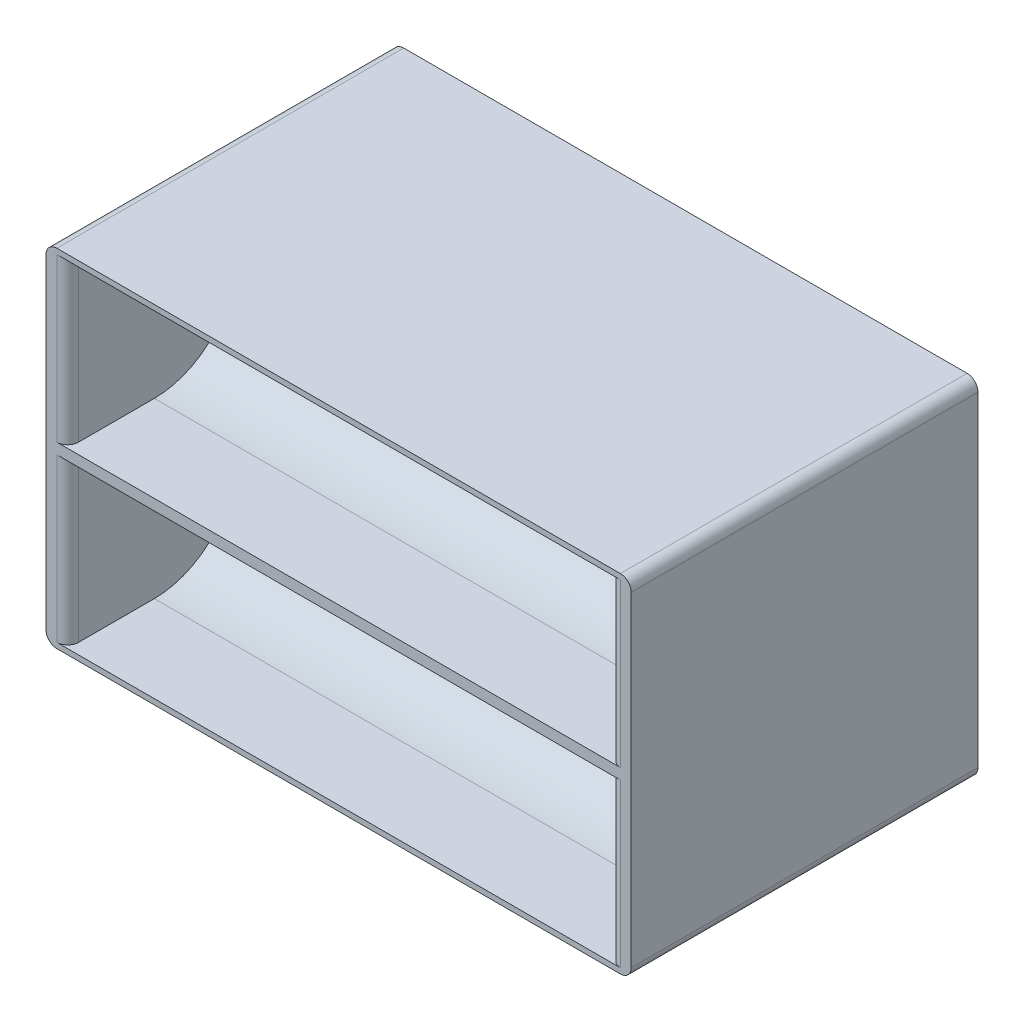
ISO-10303-21;
HEADER;
FILE_DESCRIPTION(('STEP AP214'),'2;1');
FILE_NAME('part.step','',(''),(''),'','','');
FILE_SCHEMA(('AUTOMOTIVE_DESIGN { 1 0 10303 214 1 1 1 1 }'));
ENDSEC;
DATA;
#1=APPLICATION_CONTEXT('core data for automotive mechanical design processes');
#2=APPLICATION_PROTOCOL_DEFINITION('international standard','automotive_design',2000,#1);
#3=PRODUCT_CONTEXT('',#1,'mechanical');
#4=PRODUCT('Part','Part','',(#3));
#5=PRODUCT_RELATED_PRODUCT_CATEGORY('part','',(#4));
#6=PRODUCT_DEFINITION_FORMATION('','',#4);
#7=PRODUCT_DEFINITION_CONTEXT('part definition',#1,'design');
#8=PRODUCT_DEFINITION('design','',#6,#7);
#9=PRODUCT_DEFINITION_SHAPE('','',#8);
#10=(LENGTH_UNIT() NAMED_UNIT(*) SI_UNIT(.MILLI.,.METRE.));
#11=(NAMED_UNIT(*) PLANE_ANGLE_UNIT() SI_UNIT($,.RADIAN.));
#12=(NAMED_UNIT(*) SI_UNIT($,.STERADIAN.) SOLID_ANGLE_UNIT());
#13=UNCERTAINTY_MEASURE_WITH_UNIT(LENGTH_MEASURE(1.E-05),#10,'distance_accuracy_value','');
#14=(GEOMETRIC_REPRESENTATION_CONTEXT(3) GLOBAL_UNCERTAINTY_ASSIGNED_CONTEXT((#13)) GLOBAL_UNIT_ASSIGNED_CONTEXT((#10,
#11,#12)) REPRESENTATION_CONTEXT('',''));
#15=CARTESIAN_POINT('',(0.,0.,0.));
#16=DIRECTION('',(0.,0.,1.));
#17=DIRECTION('',(1.,0.,0.));
#18=AXIS2_PLACEMENT_3D('',#15,#16,#17);
#19=CARTESIAN_POINT('',(27.,32.,16.));
#20=DIRECTION('',(0.,0.,-1.));
#21=DIRECTION('',(-1.,0.,0.));
#22=AXIS2_PLACEMENT_3D('',#19,#20,#21);
#23=PLANE('',#22);
#24=DIRECTION('',(0.,-1.,0.));
#25=VECTOR('',#24,1.);
#26=CARTESIAN_POINT('',(-27.,32.,16.));
#27=LINE('',#26,#25);
#28=CARTESIAN_POINT('',(-27.,31.,16.));
#29=VERTEX_POINT('',#28);
#30=CARTESIAN_POINT('',(-27.,1.,16.));
#31=VERTEX_POINT('',#30);
#32=EDGE_CURVE('E376',#29,#31,#27,.T.);
#33=ORIENTED_EDGE('',*,*,#32,.T.);
#34=CARTESIAN_POINT('',(-26.,1.,16.));
#35=DIRECTION('',(0.,0.,-1.));
#36=DIRECTION('',(-1.,0.,0.));
#37=AXIS2_PLACEMENT_3D('',#34,#35,#36);
#38=CIRCLE('',#37,1.);
#39=CARTESIAN_POINT('',(-26.,0.,16.));
#40=VERTEX_POINT('',#39);
#41=EDGE_CURVE('E402',#31,#40,#38,.F.);
#42=ORIENTED_EDGE('',*,*,#41,.T.);
#43=DIRECTION('',(1.,0.,0.));
#44=VECTOR('',#43,1.);
#45=CARTESIAN_POINT('',(27.,0.,16.));
#46=LINE('',#45,#44);
#47=CARTESIAN_POINT('',(26.,0.,16.));
#48=VERTEX_POINT('',#47);
#49=EDGE_CURVE('E355',#40,#48,#46,.T.);
#50=ORIENTED_EDGE('',*,*,#49,.T.);
#51=CARTESIAN_POINT('',(26.,1.,16.));
#52=DIRECTION('',(0.,0.,-1.));
#53=DIRECTION('',(-1.,0.,0.));
#54=AXIS2_PLACEMENT_3D('',#51,#52,#53);
#55=CIRCLE('',#54,1.);
#56=CARTESIAN_POINT('',(27.,1.,16.));
#57=VERTEX_POINT('',#56);
#58=EDGE_CURVE('E400',#48,#57,#55,.F.);
#59=ORIENTED_EDGE('',*,*,#58,.T.);
#60=DIRECTION('',(0.,-1.,0.));
#61=VECTOR('',#60,1.);
#62=CARTESIAN_POINT('',(27.,32.,16.));
#63=LINE('',#62,#61);
#64=CARTESIAN_POINT('',(27.,31.,16.));
#65=VERTEX_POINT('',#64);
#66=EDGE_CURVE('E373',#65,#57,#63,.T.);
#67=ORIENTED_EDGE('',*,*,#66,.F.);
#68=CARTESIAN_POINT('',(26.,31.,16.));
#69=DIRECTION('',(0.,0.,-1.));
#70=DIRECTION('',(-1.,0.,0.));
#71=AXIS2_PLACEMENT_3D('',#68,#69,#70);
#72=CIRCLE('',#71,1.);
#73=CARTESIAN_POINT('',(26.,32.,16.));
#74=VERTEX_POINT('',#73);
#75=EDGE_CURVE('E398',#65,#74,#72,.F.);
#76=ORIENTED_EDGE('',*,*,#75,.T.);
#77=DIRECTION('',(1.,0.,0.));
#78=VECTOR('',#77,1.);
#79=CARTESIAN_POINT('',(27.,32.,16.));
#80=LINE('',#79,#78);
#81=CARTESIAN_POINT('',(-26.,32.,16.));
#82=VERTEX_POINT('',#81);
#83=EDGE_CURVE('E356',#82,#74,#80,.T.);
#84=ORIENTED_EDGE('',*,*,#83,.F.);
#85=CARTESIAN_POINT('',(-26.,31.,16.));
#86=DIRECTION('',(0.,0.,-1.));
#87=DIRECTION('',(-1.,0.,0.));
#88=AXIS2_PLACEMENT_3D('',#85,#86,#87);
#89=CIRCLE('',#88,1.);
#90=EDGE_CURVE('E396',#82,#29,#89,.F.);
#91=ORIENTED_EDGE('',*,*,#90,.T.);
#92=EDGE_LOOP('',(#33,#42,#50,#59,#67,#76,#84,#91));
#93=FACE_BOUND('',#92,.T.);
#94=DIRECTION('',(-1.,0.,0.));
#95=VECTOR('',#94,1.);
#96=CARTESIAN_POINT('',(25.,16.5,16.));
#97=LINE('',#96,#95);
#98=CARTESIAN_POINT('',(26.,16.5,16.));
#99=VERTEX_POINT('',#98);
#100=CARTESIAN_POINT('',(-26.,16.5,16.));
#101=VERTEX_POINT('',#100);
#102=EDGE_CURVE('E302',#99,#101,#97,.T.);
#103=ORIENTED_EDGE('',*,*,#102,.T.);
#104=DIRECTION('',(0.,-1.,0.));
#105=VECTOR('',#104,1.);
#106=CARTESIAN_POINT('',(-26.,31.5,16.));
#107=LINE('',#106,#105);
#108=CARTESIAN_POINT('',(-26.,31.5,16.));
#109=VERTEX_POINT('',#108);
#110=EDGE_CURVE('E387',#101,#109,#107,.F.);
#111=ORIENTED_EDGE('',*,*,#110,.T.);
#112=DIRECTION('',(-1.,0.,0.));
#113=VECTOR('',#112,1.);
#114=CARTESIAN_POINT('',(25.,31.5,16.));
#115=LINE('',#114,#113);
#116=CARTESIAN_POINT('',(26.,31.5,16.));
#117=VERTEX_POINT('',#116);
#118=EDGE_CURVE('E304',#117,#109,#115,.T.);
#119=ORIENTED_EDGE('',*,*,#118,.F.);
#120=DIRECTION('',(0.,-1.,0.));
#121=VECTOR('',#120,1.);
#122=CARTESIAN_POINT('',(26.,32.,16.));
#123=LINE('',#122,#121);
#124=EDGE_CURVE('E384',#117,#99,#123,.T.);
#125=ORIENTED_EDGE('',*,*,#124,.T.);
#126=EDGE_LOOP('',(#103,#111,#119,#125));
#127=FACE_BOUND('',#126,.T.);
#128=DIRECTION('',(0.,-1.,0.));
#129=VECTOR('',#128,1.);
#130=CARTESIAN_POINT('',(26.,0.5,16.));
#131=LINE('',#130,#129);
#132=CARTESIAN_POINT('',(26.,15.5,16.));
#133=VERTEX_POINT('',#132);
#134=CARTESIAN_POINT('',(26.,0.5,16.));
#135=VERTEX_POINT('',#134);
#136=EDGE_CURVE('E393',#133,#135,#131,.T.);
#137=ORIENTED_EDGE('',*,*,#136,.T.);
#138=DIRECTION('',(-1.,0.,0.));
#139=VECTOR('',#138,1.);
#140=CARTESIAN_POINT('',(25.,0.5,16.));
#141=LINE('',#140,#139);
#142=CARTESIAN_POINT('',(-26.,0.5,16.));
#143=VERTEX_POINT('',#142);
#144=EDGE_CURVE('E264',#135,#143,#141,.T.);
#145=ORIENTED_EDGE('',*,*,#144,.T.);
#146=DIRECTION('',(0.,-1.,0.));
#147=VECTOR('',#146,1.);
#148=CARTESIAN_POINT('',(-26.,32.,16.));
#149=LINE('',#148,#147);
#150=CARTESIAN_POINT('',(-26.,15.5,16.));
#151=VERTEX_POINT('',#150);
#152=EDGE_CURVE('E390',#143,#151,#149,.F.);
#153=ORIENTED_EDGE('',*,*,#152,.T.);
#154=DIRECTION('',(-1.,0.,0.));
#155=VECTOR('',#154,1.);
#156=CARTESIAN_POINT('',(25.,15.5,16.));
#157=LINE('',#156,#155);
#158=EDGE_CURVE('E279',#133,#151,#157,.T.);
#159=ORIENTED_EDGE('',*,*,#158,.F.);
#160=EDGE_LOOP('',(#137,#145,#153,#159));
#161=FACE_BOUND('',#160,.T.);
#162=ADVANCED_FACE('F35',(#93,#127,#161),#23,.F.);
#163=CARTESIAN_POINT('',(27.,32.,-16.));
#164=DIRECTION('',(0.,0.,1.));
#165=DIRECTION('',(1.,0.,0.));
#166=AXIS2_PLACEMENT_3D('',#163,#164,#165);
#167=PLANE('',#166);
#168=DIRECTION('',(0.,1.,0.));
#169=VECTOR('',#168,1.);
#170=CARTESIAN_POINT('',(26.,32.,-16.));
#171=LINE('',#170,#169);
#172=CARTESIAN_POINT('',(26.,0.5,-16.));
#173=VERTEX_POINT('',#172);
#174=CARTESIAN_POINT('',(26.,15.5,-16.));
#175=VERTEX_POINT('',#174);
#176=EDGE_CURVE('E417',#173,#175,#171,.T.);
#177=ORIENTED_EDGE('',*,*,#176,.T.);
#178=DIRECTION('',(-1.,0.,0.));
#179=VECTOR('',#178,1.);
#180=CARTESIAN_POINT('',(25.,15.5,-16.));
#181=LINE('',#180,#179);
#182=CARTESIAN_POINT('',(-26.,15.5,-16.));
#183=VERTEX_POINT('',#182);
#184=EDGE_CURVE('E328',#175,#183,#181,.T.);
#185=ORIENTED_EDGE('',*,*,#184,.T.);
#186=DIRECTION('',(0.,1.,0.));
#187=VECTOR('',#186,1.);
#188=CARTESIAN_POINT('',(-26.,0.5,-16.));
#189=LINE('',#188,#187);
#190=CARTESIAN_POINT('',(-26.,0.5,-16.));
#191=VERTEX_POINT('',#190);
#192=EDGE_CURVE('E414',#183,#191,#189,.F.);
#193=ORIENTED_EDGE('',*,*,#192,.T.);
#194=DIRECTION('',(-1.,0.,0.));
#195=VECTOR('',#194,1.);
#196=CARTESIAN_POINT('',(25.,0.5,-16.));
#197=LINE('',#196,#195);
#198=EDGE_CURVE('E330',#173,#191,#197,.T.);
#199=ORIENTED_EDGE('',*,*,#198,.F.);
#200=EDGE_LOOP('',(#177,#185,#193,#199));
#201=FACE_BOUND('',#200,.T.);
#202=DIRECTION('',(-1.,0.,0.));
#203=VECTOR('',#202,1.);
#204=CARTESIAN_POINT('',(27.,0.,-16.));
#205=LINE('',#204,#203);
#206=CARTESIAN_POINT('',(26.,0.,-16.));
#207=VERTEX_POINT('',#206);
#208=CARTESIAN_POINT('',(-26.,0.,-16.));
#209=VERTEX_POINT('',#208);
#210=EDGE_CURVE('E360',#207,#209,#205,.T.);
#211=ORIENTED_EDGE('',*,*,#210,.T.);
#212=CARTESIAN_POINT('',(-26.,1.,-16.));
#213=DIRECTION('',(0.,0.,1.));
#214=DIRECTION('',(1.,0.,0.));
#215=AXIS2_PLACEMENT_3D('',#212,#213,#214);
#216=CIRCLE('',#215,1.);
#217=CARTESIAN_POINT('',(-27.,1.,-16.));
#218=VERTEX_POINT('',#217);
#219=EDGE_CURVE('E426',#209,#218,#216,.F.);
#220=ORIENTED_EDGE('',*,*,#219,.T.);
#221=DIRECTION('',(0.,-1.,0.));
#222=VECTOR('',#221,1.);
#223=CARTESIAN_POINT('',(-27.,32.,-16.));
#224=LINE('',#223,#222);
#225=CARTESIAN_POINT('',(-27.,31.,-16.));
#226=VERTEX_POINT('',#225);
#227=EDGE_CURVE('E363',#226,#218,#224,.T.);
#228=ORIENTED_EDGE('',*,*,#227,.F.);
#229=CARTESIAN_POINT('',(-26.,31.,-16.));
#230=DIRECTION('',(0.,0.,1.));
#231=DIRECTION('',(1.,0.,0.));
#232=AXIS2_PLACEMENT_3D('',#229,#230,#231);
#233=CIRCLE('',#232,1.);
#234=CARTESIAN_POINT('',(-26.,32.,-16.));
#235=VERTEX_POINT('',#234);
#236=EDGE_CURVE('E420',#226,#235,#233,.F.);
#237=ORIENTED_EDGE('',*,*,#236,.T.);
#238=DIRECTION('',(-1.,0.,0.));
#239=VECTOR('',#238,1.);
#240=CARTESIAN_POINT('',(27.,32.,-16.));
#241=LINE('',#240,#239);
#242=CARTESIAN_POINT('',(26.,32.,-16.));
#243=VERTEX_POINT('',#242);
#244=EDGE_CURVE('E359',#243,#235,#241,.T.);
#245=ORIENTED_EDGE('',*,*,#244,.F.);
#246=CARTESIAN_POINT('',(26.,31.,-16.));
#247=DIRECTION('',(0.,0.,1.));
#248=DIRECTION('',(1.,0.,0.));
#249=AXIS2_PLACEMENT_3D('',#246,#247,#248);
#250=CIRCLE('',#249,1.);
#251=CARTESIAN_POINT('',(27.,31.,-16.));
#252=VERTEX_POINT('',#251);
#253=EDGE_CURVE('E422',#243,#252,#250,.F.);
#254=ORIENTED_EDGE('',*,*,#253,.T.);
#255=DIRECTION('',(0.,-1.,0.));
#256=VECTOR('',#255,1.);
#257=CARTESIAN_POINT('',(27.,32.,-16.));
#258=LINE('',#257,#256);
#259=CARTESIAN_POINT('',(27.,1.,-16.));
#260=VERTEX_POINT('',#259);
#261=EDGE_CURVE('E370',#252,#260,#258,.T.);
#262=ORIENTED_EDGE('',*,*,#261,.T.);
#263=CARTESIAN_POINT('',(26.,1.,-16.));
#264=DIRECTION('',(0.,0.,1.));
#265=DIRECTION('',(1.,0.,0.));
#266=AXIS2_PLACEMENT_3D('',#263,#264,#265);
#267=CIRCLE('',#266,1.);
#268=EDGE_CURVE('E424',#260,#207,#267,.F.);
#269=ORIENTED_EDGE('',*,*,#268,.T.);
#270=EDGE_LOOP('',(#211,#220,#228,#237,#245,#254,#262,#269));
#271=FACE_BOUND('',#270,.T.);
#272=DIRECTION('',(-1.,0.,0.));
#273=VECTOR('',#272,1.);
#274=CARTESIAN_POINT('',(25.,31.5,-16.));
#275=LINE('',#274,#273);
#276=CARTESIAN_POINT('',(26.,31.5,-16.));
#277=VERTEX_POINT('',#276);
#278=CARTESIAN_POINT('',(-26.,31.5,-16.));
#279=VERTEX_POINT('',#278);
#280=EDGE_CURVE('E353',#277,#279,#275,.T.);
#281=ORIENTED_EDGE('',*,*,#280,.T.);
#282=DIRECTION('',(0.,1.,0.));
#283=VECTOR('',#282,1.);
#284=CARTESIAN_POINT('',(-26.,32.,-16.));
#285=LINE('',#284,#283);
#286=CARTESIAN_POINT('',(-26.,16.5,-16.));
#287=VERTEX_POINT('',#286);
#288=EDGE_CURVE('E411',#279,#287,#285,.F.);
#289=ORIENTED_EDGE('',*,*,#288,.T.);
#290=DIRECTION('',(-1.,0.,0.));
#291=VECTOR('',#290,1.);
#292=CARTESIAN_POINT('',(25.,16.5,-16.));
#293=LINE('',#292,#291);
#294=CARTESIAN_POINT('',(26.,16.5,-16.));
#295=VERTEX_POINT('',#294);
#296=EDGE_CURVE('E346',#295,#287,#293,.T.);
#297=ORIENTED_EDGE('',*,*,#296,.F.);
#298=DIRECTION('',(0.,1.,0.));
#299=VECTOR('',#298,1.);
#300=CARTESIAN_POINT('',(26.,31.5,-16.));
#301=LINE('',#300,#299);
#302=EDGE_CURVE('E408',#295,#277,#301,.T.);
#303=ORIENTED_EDGE('',*,*,#302,.T.);
#304=EDGE_LOOP('',(#281,#289,#297,#303));
#305=FACE_BOUND('',#304,.T.);
#306=ADVANCED_FACE('F512',(#201,#271,#305),#167,.F.);
#307=CARTESIAN_POINT('',(-27.,32.,16.));
#308=DIRECTION('',(1.,0.,0.));
#309=DIRECTION('',(0.,0.,-1.));
#310=AXIS2_PLACEMENT_3D('',#307,#308,#309);
#311=PLANE('',#310);
#312=ORIENTED_EDGE('',*,*,#227,.T.);
#313=DIRECTION('',(0.,0.,1.));
#314=VECTOR('',#313,1.);
#315=CARTESIAN_POINT('',(-27.,1.,16.));
#316=LINE('',#315,#314);
#317=EDGE_CURVE('E381',#218,#31,#316,.T.);
#318=ORIENTED_EDGE('',*,*,#317,.T.);
#319=ORIENTED_EDGE('',*,*,#32,.F.);
#320=DIRECTION('',(0.,0.,1.));
#321=VECTOR('',#320,1.);
#322=CARTESIAN_POINT('',(-27.,31.,-16.));
#323=LINE('',#322,#321);
#324=EDGE_CURVE('E379',#29,#226,#323,.F.);
#325=ORIENTED_EDGE('',*,*,#324,.T.);
#326=EDGE_LOOP('',(#312,#318,#319,#325));
#327=FACE_BOUND('',#326,.T.);
#328=ADVANCED_FACE('F514',(#327),#311,.F.);
#329=CARTESIAN_POINT('',(27.,32.,16.));
#330=DIRECTION('',(-1.,0.,0.));
#331=DIRECTION('',(0.,0.,1.));
#332=AXIS2_PLACEMENT_3D('',#329,#330,#331);
#333=PLANE('',#332);
#334=ORIENTED_EDGE('',*,*,#66,.T.);
#335=DIRECTION('',(0.,0.,-1.));
#336=VECTOR('',#335,1.);
#337=CARTESIAN_POINT('',(27.,1.,16.));
#338=LINE('',#337,#336);
#339=EDGE_CURVE('E430',#57,#260,#338,.T.);
#340=ORIENTED_EDGE('',*,*,#339,.T.);
#341=ORIENTED_EDGE('',*,*,#261,.F.);
#342=DIRECTION('',(0.,0.,-1.));
#343=VECTOR('',#342,1.);
#344=CARTESIAN_POINT('',(27.,31.,16.));
#345=LINE('',#344,#343);
#346=EDGE_CURVE('E428',#252,#65,#345,.F.);
#347=ORIENTED_EDGE('',*,*,#346,.T.);
#348=EDGE_LOOP('',(#334,#340,#341,#347));
#349=FACE_BOUND('',#348,.T.);
#350=ADVANCED_FACE('F522',(#349),#333,.F.);
#351=CARTESIAN_POINT('',(0.,32.,0.));
#352=DIRECTION('',(0.,1.,0.));
#353=DIRECTION('',(0.,0.,1.));
#354=AXIS2_PLACEMENT_3D('',#351,#352,#353);
#355=PLANE('',#354);
#356=ORIENTED_EDGE('',*,*,#83,.T.);
#357=DIRECTION('',(0.,0.,-1.));
#358=VECTOR('',#357,1.);
#359=CARTESIAN_POINT('',(26.,32.,-16.));
#360=LINE('',#359,#358);
#361=EDGE_CURVE('E436',#74,#243,#360,.T.);
#362=ORIENTED_EDGE('',*,*,#361,.T.);
#363=ORIENTED_EDGE('',*,*,#244,.T.);
#364=DIRECTION('',(0.,0.,1.));
#365=VECTOR('',#364,1.);
#366=CARTESIAN_POINT('',(-26.,32.,16.));
#367=LINE('',#366,#365);
#368=EDGE_CURVE('E433',#235,#82,#367,.T.);
#369=ORIENTED_EDGE('',*,*,#368,.T.);
#370=EDGE_LOOP('',(#356,#362,#363,#369));
#371=FACE_BOUND('',#370,.T.);
#372=ADVANCED_FACE('F533',(#371),#355,.T.);
#373=CARTESIAN_POINT('',(0.,0.,0.));
#374=DIRECTION('',(0.,1.,0.));
#375=DIRECTION('',(0.,0.,1.));
#376=AXIS2_PLACEMENT_3D('',#373,#374,#375);
#377=PLANE('',#376);
#378=ORIENTED_EDGE('',*,*,#49,.F.);
#379=DIRECTION('',(0.,0.,1.));
#380=VECTOR('',#379,1.);
#381=CARTESIAN_POINT('',(-26.,0.,0.));
#382=LINE('',#381,#380);
#383=EDGE_CURVE('E406',#40,#209,#382,.F.);
#384=ORIENTED_EDGE('',*,*,#383,.T.);
#385=ORIENTED_EDGE('',*,*,#210,.F.);
#386=DIRECTION('',(0.,0.,-1.));
#387=VECTOR('',#386,1.);
#388=CARTESIAN_POINT('',(26.,0.,0.));
#389=LINE('',#388,#387);
#390=EDGE_CURVE('E404',#207,#48,#389,.F.);
#391=ORIENTED_EDGE('',*,*,#390,.T.);
#392=EDGE_LOOP('',(#378,#384,#385,#391));
#393=FACE_BOUND('',#392,.T.);
#394=ADVANCED_FACE('F530',(#393),#377,.F.);
#395=CARTESIAN_POINT('',(25.,31.5,-8.));
#396=DIRECTION('',(0.,-1.,0.));
#397=DIRECTION('',(0.,0.,-1.));
#398=AXIS2_PLACEMENT_3D('',#395,#396,#397);
#399=PLANE('',#398);
#400=ORIENTED_EDGE('',*,*,#280,.F.);
#401=CARTESIAN_POINT('',(26.,31.5,-15.));
#402=DIRECTION('',(0.,-1.,0.));
#403=DIRECTION('',(0.,0.,-1.));
#404=AXIS2_PLACEMENT_3D('',#401,#402,#403);
#405=CIRCLE('',#404,1.);
#406=CARTESIAN_POINT('',(25.,31.5,-15.));
#407=VERTEX_POINT('',#406);
#408=EDGE_CURVE('E43',#277,#407,#405,.F.);
#409=ORIENTED_EDGE('',*,*,#408,.T.);
#410=DIRECTION('',(0.,0.,1.));
#411=VECTOR('',#410,1.);
#412=CARTESIAN_POINT('',(25.,31.5,-8.));
#413=LINE('',#412,#411);
#414=CARTESIAN_POINT('',(25.,31.5,-8.));
#415=VERTEX_POINT('',#414);
#416=EDGE_CURVE('E340',#407,#415,#413,.T.);
#417=ORIENTED_EDGE('',*,*,#416,.T.);
#418=DIRECTION('',(-1.,0.,0.));
#419=VECTOR('',#418,1.);
#420=CARTESIAN_POINT('',(25.,31.5,-8.));
#421=LINE('',#420,#419);
#422=CARTESIAN_POINT('',(-25.,31.5,-8.));
#423=VERTEX_POINT('',#422);
#424=EDGE_CURVE('E350',#415,#423,#421,.T.);
#425=ORIENTED_EDGE('',*,*,#424,.T.);
#426=DIRECTION('',(0.,0.,1.));
#427=VECTOR('',#426,1.);
#428=CARTESIAN_POINT('',(-25.,31.5,-8.));
#429=LINE('',#428,#427);
#430=CARTESIAN_POINT('',(-25.,31.5,-15.));
#431=VERTEX_POINT('',#430);
#432=EDGE_CURVE('E332',#431,#423,#429,.T.);
#433=ORIENTED_EDGE('',*,*,#432,.F.);
#434=CARTESIAN_POINT('',(-26.,31.5,-15.));
#435=DIRECTION('',(0.,-1.,0.));
#436=DIRECTION('',(0.,0.,-1.));
#437=AXIS2_PLACEMENT_3D('',#434,#435,#436);
#438=CIRCLE('',#437,1.);
#439=EDGE_CURVE('E485',#431,#279,#438,.F.);
#440=ORIENTED_EDGE('',*,*,#439,.T.);
#441=EDGE_LOOP('',(#400,#409,#417,#425,#433,#440));
#442=FACE_BOUND('',#441,.T.);
#443=ADVANCED_FACE('F502',(#442),#399,.T.);
#444=CARTESIAN_POINT('',(25.,24.,-8.));
#445=DIRECTION('',(-1.,0.,0.));
#446=DIRECTION('',(0.,0.,1.));
#447=AXIS2_PLACEMENT_3D('',#444,#445,#446);
#448=CYLINDRICAL_SURFACE('',#447,7.5);
#449=ORIENTED_EDGE('',*,*,#424,.F.);
#450=CARTESIAN_POINT('',(25.,24.,-8.));
#451=DIRECTION('',(1.,0.,0.));
#452=DIRECTION('',(0.,0.,1.));
#453=AXIS2_PLACEMENT_3D('',#450,#451,#452);
#454=CIRCLE('',#453,7.5);
#455=CARTESIAN_POINT('',(25.,16.5,-8.));
#456=VERTEX_POINT('',#455);
#457=EDGE_CURVE('E342',#415,#456,#454,.T.);
#458=ORIENTED_EDGE('',*,*,#457,.T.);
#459=DIRECTION('',(-1.,0.,0.));
#460=VECTOR('',#459,1.);
#461=CARTESIAN_POINT('',(25.,16.5,-8.));
#462=LINE('',#461,#460);
#463=CARTESIAN_POINT('',(-25.,16.5,-8.));
#464=VERTEX_POINT('',#463);
#465=EDGE_CURVE('E348',#456,#464,#462,.T.);
#466=ORIENTED_EDGE('',*,*,#465,.T.);
#467=CARTESIAN_POINT('',(-25.,24.,-8.));
#468=DIRECTION('',(1.,0.,0.));
#469=DIRECTION('',(0.,0.,1.));
#470=AXIS2_PLACEMENT_3D('',#467,#468,#469);
#471=CIRCLE('',#470,7.5);
#472=EDGE_CURVE('E334',#423,#464,#471,.T.);
#473=ORIENTED_EDGE('',*,*,#472,.F.);
#474=EDGE_LOOP('',(#449,#458,#466,#473));
#475=FACE_BOUND('',#474,.T.);
#476=ADVANCED_FACE('F506',(#475),#448,.F.);
#477=CARTESIAN_POINT('',(25.,16.5,-16.));
#478=DIRECTION('',(0.,1.,0.));
#479=DIRECTION('',(0.,0.,1.));
#480=AXIS2_PLACEMENT_3D('',#477,#478,#479);
#481=PLANE('',#480);
#482=ORIENTED_EDGE('',*,*,#465,.F.);
#483=DIRECTION('',(0.,0.,-1.));
#484=VECTOR('',#483,1.);
#485=CARTESIAN_POINT('',(25.,16.5,-16.));
#486=LINE('',#485,#484);
#487=CARTESIAN_POINT('',(25.,16.5,-15.));
#488=VERTEX_POINT('',#487);
#489=EDGE_CURVE('E344',#456,#488,#486,.T.);
#490=ORIENTED_EDGE('',*,*,#489,.T.);
#491=CARTESIAN_POINT('',(26.,16.5,-15.));
#492=DIRECTION('',(0.,1.,0.));
#493=DIRECTION('',(0.,0.,1.));
#494=AXIS2_PLACEMENT_3D('',#491,#492,#493);
#495=CIRCLE('',#494,1.);
#496=EDGE_CURVE('E11',#488,#295,#495,.F.);
#497=ORIENTED_EDGE('',*,*,#496,.T.);
#498=ORIENTED_EDGE('',*,*,#296,.T.);
#499=CARTESIAN_POINT('',(-26.,16.5,-15.));
#500=DIRECTION('',(0.,1.,0.));
#501=DIRECTION('',(0.,0.,1.));
#502=AXIS2_PLACEMENT_3D('',#499,#500,#501);
#503=CIRCLE('',#502,1.);
#504=CARTESIAN_POINT('',(-25.,16.5,-15.));
#505=VERTEX_POINT('',#504);
#506=EDGE_CURVE('E488',#287,#505,#503,.F.);
#507=ORIENTED_EDGE('',*,*,#506,.T.);
#508=DIRECTION('',(0.,0.,-1.));
#509=VECTOR('',#508,1.);
#510=CARTESIAN_POINT('',(-25.,16.5,-16.));
#511=LINE('',#510,#509);
#512=EDGE_CURVE('E337',#464,#505,#511,.T.);
#513=ORIENTED_EDGE('',*,*,#512,.F.);
#514=EDGE_LOOP('',(#482,#490,#497,#498,#507,#513));
#515=FACE_BOUND('',#514,.T.);
#516=ADVANCED_FACE('F493',(#515),#481,.T.);
#517=CARTESIAN_POINT('',(25.,24.,-8.));
#518=DIRECTION('',(-1.,0.,0.));
#519=DIRECTION('',(0.,0.,1.));
#520=AXIS2_PLACEMENT_3D('',#517,#518,#519);
#521=PLANE('',#520);
#522=ORIENTED_EDGE('',*,*,#416,.F.);
#523=DIRECTION('',(0.,1.,0.));
#524=VECTOR('',#523,1.);
#525=CARTESIAN_POINT('',(25.,16.5,-15.));
#526=LINE('',#525,#524);
#527=EDGE_CURVE('E56',#407,#488,#526,.F.);
#528=ORIENTED_EDGE('',*,*,#527,.T.);
#529=ORIENTED_EDGE('',*,*,#489,.F.);
#530=ORIENTED_EDGE('',*,*,#457,.F.);
#531=EDGE_LOOP('',(#522,#528,#529,#530));
#532=FACE_BOUND('',#531,.T.);
#533=ADVANCED_FACE('F508',(#532),#521,.T.);
#534=CARTESIAN_POINT('',(-25.,24.,-8.));
#535=DIRECTION('',(-1.,0.,0.));
#536=DIRECTION('',(0.,0.,1.));
#537=AXIS2_PLACEMENT_3D('',#534,#535,#536);
#538=PLANE('',#537);
#539=ORIENTED_EDGE('',*,*,#512,.T.);
#540=DIRECTION('',(0.,1.,0.));
#541=VECTOR('',#540,1.);
#542=CARTESIAN_POINT('',(-25.,24.,-15.));
#543=LINE('',#542,#541);
#544=EDGE_CURVE('E452',#505,#431,#543,.T.);
#545=ORIENTED_EDGE('',*,*,#544,.T.);
#546=ORIENTED_EDGE('',*,*,#432,.T.);
#547=ORIENTED_EDGE('',*,*,#472,.T.);
#548=EDGE_LOOP('',(#539,#545,#546,#547));
#549=FACE_BOUND('',#548,.T.);
#550=ADVANCED_FACE('F498',(#549),#538,.F.);
#551=CARTESIAN_POINT('',(25.,0.5,-8.));
#552=DIRECTION('',(0.,1.,0.));
#553=DIRECTION('',(0.,0.,1.));
#554=AXIS2_PLACEMENT_3D('',#551,#552,#553);
#555=PLANE('',#554);
#556=DIRECTION('',(-1.,0.,0.));
#557=VECTOR('',#556,1.);
#558=CARTESIAN_POINT('',(25.,0.5,-8.));
#559=LINE('',#558,#557);
#560=CARTESIAN_POINT('',(25.,0.5,-8.));
#561=VERTEX_POINT('',#560);
#562=CARTESIAN_POINT('',(-25.,0.5,-8.));
#563=VERTEX_POINT('',#562);
#564=EDGE_CURVE('E323',#561,#563,#559,.T.);
#565=ORIENTED_EDGE('',*,*,#564,.F.);
#566=DIRECTION('',(0.,0.,-1.));
#567=VECTOR('',#566,1.);
#568=CARTESIAN_POINT('',(25.,0.5,-8.));
#569=LINE('',#568,#567);
#570=CARTESIAN_POINT('',(25.,0.5,-15.));
#571=VERTEX_POINT('',#570);
#572=EDGE_CURVE('E316',#561,#571,#569,.T.);
#573=ORIENTED_EDGE('',*,*,#572,.T.);
#574=CARTESIAN_POINT('',(26.,0.5,-15.));
#575=DIRECTION('',(0.,1.,0.));
#576=DIRECTION('',(0.,0.,1.));
#577=AXIS2_PLACEMENT_3D('',#574,#575,#576);
#578=CIRCLE('',#577,1.);
#579=EDGE_CURVE('E477',#571,#173,#578,.F.);
#580=ORIENTED_EDGE('',*,*,#579,.T.);
#581=ORIENTED_EDGE('',*,*,#198,.T.);
#582=CARTESIAN_POINT('',(-26.,0.5,-15.));
#583=DIRECTION('',(0.,1.,0.));
#584=DIRECTION('',(0.,0.,1.));
#585=AXIS2_PLACEMENT_3D('',#582,#583,#584);
#586=CIRCLE('',#585,1.);
#587=CARTESIAN_POINT('',(-25.,0.5,-15.));
#588=VERTEX_POINT('',#587);
#589=EDGE_CURVE('E483',#191,#588,#586,.F.);
#590=ORIENTED_EDGE('',*,*,#589,.T.);
#591=DIRECTION('',(0.,0.,-1.));
#592=VECTOR('',#591,1.);
#593=CARTESIAN_POINT('',(-25.,0.5,-8.));
#594=LINE('',#593,#592);
#595=EDGE_CURVE('E308',#563,#588,#594,.T.);
#596=ORIENTED_EDGE('',*,*,#595,.F.);
#597=EDGE_LOOP('',(#565,#573,#580,#581,#590,#596));
#598=FACE_BOUND('',#597,.T.);
#599=ADVANCED_FACE('F735',(#598),#555,.T.);
#600=CARTESIAN_POINT('',(25.,15.5,-16.));
#601=DIRECTION('',(0.,-1.,0.));
#602=DIRECTION('',(0.,0.,-1.));
#603=AXIS2_PLACEMENT_3D('',#600,#601,#602);
#604=PLANE('',#603);
#605=ORIENTED_EDGE('',*,*,#184,.F.);
#606=CARTESIAN_POINT('',(26.,15.5,-15.));
#607=DIRECTION('',(0.,-1.,0.));
#608=DIRECTION('',(0.,0.,-1.));
#609=AXIS2_PLACEMENT_3D('',#606,#607,#608);
#610=CIRCLE('',#609,1.);
#611=CARTESIAN_POINT('',(25.,15.5,-15.));
#612=VERTEX_POINT('',#611);
#613=EDGE_CURVE('E475',#175,#612,#610,.F.);
#614=ORIENTED_EDGE('',*,*,#613,.T.);
#615=DIRECTION('',(0.,0.,1.));
#616=VECTOR('',#615,1.);
#617=CARTESIAN_POINT('',(25.,15.5,-16.));
#618=LINE('',#617,#616);
#619=CARTESIAN_POINT('',(25.,15.5,-8.));
#620=VERTEX_POINT('',#619);
#621=EDGE_CURVE('E319',#612,#620,#618,.T.);
#622=ORIENTED_EDGE('',*,*,#621,.T.);
#623=DIRECTION('',(-1.,0.,0.));
#624=VECTOR('',#623,1.);
#625=CARTESIAN_POINT('',(25.,15.5,-8.));
#626=LINE('',#625,#624);
#627=CARTESIAN_POINT('',(-25.,15.5,-8.));
#628=VERTEX_POINT('',#627);
#629=EDGE_CURVE('E325',#620,#628,#626,.T.);
#630=ORIENTED_EDGE('',*,*,#629,.T.);
#631=DIRECTION('',(0.,0.,1.));
#632=VECTOR('',#631,1.);
#633=CARTESIAN_POINT('',(-25.,15.5,-16.));
#634=LINE('',#633,#632);
#635=CARTESIAN_POINT('',(-25.,15.5,-15.));
#636=VERTEX_POINT('',#635);
#637=EDGE_CURVE('E311',#636,#628,#634,.T.);
#638=ORIENTED_EDGE('',*,*,#637,.F.);
#639=CARTESIAN_POINT('',(-26.,15.5,-15.));
#640=DIRECTION('',(0.,-1.,0.));
#641=DIRECTION('',(0.,0.,-1.));
#642=AXIS2_PLACEMENT_3D('',#639,#640,#641);
#643=CIRCLE('',#642,1.);
#644=EDGE_CURVE('E480',#636,#183,#643,.F.);
#645=ORIENTED_EDGE('',*,*,#644,.T.);
#646=EDGE_LOOP('',(#605,#614,#622,#630,#638,#645));
#647=FACE_BOUND('',#646,.T.);
#648=ADVANCED_FACE('F731',(#647),#604,.T.);
#649=CARTESIAN_POINT('',(25.,8.,-8.));
#650=DIRECTION('',(-1.,0.,0.));
#651=DIRECTION('',(0.,0.,1.));
#652=AXIS2_PLACEMENT_3D('',#649,#650,#651);
#653=CYLINDRICAL_SURFACE('',#652,7.5);
#654=ORIENTED_EDGE('',*,*,#629,.F.);
#655=CARTESIAN_POINT('',(25.,8.,-8.));
#656=DIRECTION('',(1.,0.,0.));
#657=DIRECTION('',(0.,0.,-1.));
#658=AXIS2_PLACEMENT_3D('',#655,#656,#657);
#659=CIRCLE('',#658,7.5);
#660=EDGE_CURVE('E321',#620,#561,#659,.T.);
#661=ORIENTED_EDGE('',*,*,#660,.T.);
#662=ORIENTED_EDGE('',*,*,#564,.T.);
#663=CARTESIAN_POINT('',(-25.,8.,-8.));
#664=DIRECTION('',(1.,0.,0.));
#665=DIRECTION('',(0.,0.,-1.));
#666=AXIS2_PLACEMENT_3D('',#663,#664,#665);
#667=CIRCLE('',#666,7.5);
#668=EDGE_CURVE('E313',#628,#563,#667,.T.);
#669=ORIENTED_EDGE('',*,*,#668,.F.);
#670=EDGE_LOOP('',(#654,#661,#662,#669));
#671=FACE_BOUND('',#670,.T.);
#672=ADVANCED_FACE('F725',(#671),#653,.F.);
#673=CARTESIAN_POINT('',(25.,8.,-8.));
#674=DIRECTION('',(1.,0.,0.));
#675=DIRECTION('',(0.,0.,-1.));
#676=AXIS2_PLACEMENT_3D('',#673,#674,#675);
#677=PLANE('',#676);
#678=ORIENTED_EDGE('',*,*,#621,.F.);
#679=DIRECTION('',(0.,1.,0.));
#680=VECTOR('',#679,1.);
#681=CARTESIAN_POINT('',(25.,8.,-15.));
#682=LINE('',#681,#680);
#683=EDGE_CURVE('E447',#612,#571,#682,.F.);
#684=ORIENTED_EDGE('',*,*,#683,.T.);
#685=ORIENTED_EDGE('',*,*,#572,.F.);
#686=ORIENTED_EDGE('',*,*,#660,.F.);
#687=EDGE_LOOP('',(#678,#684,#685,#686));
#688=FACE_BOUND('',#687,.T.);
#689=ADVANCED_FACE('F717',(#688),#677,.F.);
#690=CARTESIAN_POINT('',(-25.,8.,-8.));
#691=DIRECTION('',(1.,0.,0.));
#692=DIRECTION('',(0.,0.,-1.));
#693=AXIS2_PLACEMENT_3D('',#690,#691,#692);
#694=PLANE('',#693);
#695=ORIENTED_EDGE('',*,*,#595,.T.);
#696=DIRECTION('',(0.,1.,0.));
#697=VECTOR('',#696,1.);
#698=CARTESIAN_POINT('',(-25.,15.5,-15.));
#699=LINE('',#698,#697);
#700=EDGE_CURVE('E449',#588,#636,#699,.T.);
#701=ORIENTED_EDGE('',*,*,#700,.T.);
#702=ORIENTED_EDGE('',*,*,#637,.T.);
#703=ORIENTED_EDGE('',*,*,#668,.T.);
#704=EDGE_LOOP('',(#695,#701,#702,#703));
#705=FACE_BOUND('',#704,.T.);
#706=ADVANCED_FACE('F713',(#705),#694,.T.);
#707=CARTESIAN_POINT('',(25.,24.,8.));
#708=DIRECTION('',(-1.,0.,0.));
#709=DIRECTION('',(0.,0.,1.));
#710=AXIS2_PLACEMENT_3D('',#707,#708,#709);
#711=CYLINDRICAL_SURFACE('',#710,7.5);
#712=DIRECTION('',(-1.,0.,0.));
#713=VECTOR('',#712,1.);
#714=CARTESIAN_POINT('',(25.,16.5,8.));
#715=LINE('',#714,#713);
#716=CARTESIAN_POINT('',(25.,16.5,8.));
#717=VERTEX_POINT('',#716);
#718=CARTESIAN_POINT('',(-25.,16.5,8.));
#719=VERTEX_POINT('',#718);
#720=EDGE_CURVE('E299',#717,#719,#715,.T.);
#721=ORIENTED_EDGE('',*,*,#720,.F.);
#722=CARTESIAN_POINT('',(25.,24.,8.));
#723=DIRECTION('',(1.,0.,0.));
#724=DIRECTION('',(0.,0.,-1.));
#725=AXIS2_PLACEMENT_3D('',#722,#723,#724);
#726=CIRCLE('',#725,7.5);
#727=CARTESIAN_POINT('',(25.,31.5,8.));
#728=VERTEX_POINT('',#727);
#729=EDGE_CURVE('E291',#717,#728,#726,.T.);
#730=ORIENTED_EDGE('',*,*,#729,.T.);
#731=DIRECTION('',(-1.,0.,0.));
#732=VECTOR('',#731,1.);
#733=CARTESIAN_POINT('',(25.,31.5,8.));
#734=LINE('',#733,#732);
#735=CARTESIAN_POINT('',(-25.,31.5,8.));
#736=VERTEX_POINT('',#735);
#737=EDGE_CURVE('E306',#728,#736,#734,.T.);
#738=ORIENTED_EDGE('',*,*,#737,.T.);
#739=CARTESIAN_POINT('',(-25.,24.,8.));
#740=DIRECTION('',(1.,0.,0.));
#741=DIRECTION('',(0.,0.,-1.));
#742=AXIS2_PLACEMENT_3D('',#739,#740,#741);
#743=CIRCLE('',#742,7.5);
#744=EDGE_CURVE('E283',#719,#736,#743,.T.);
#745=ORIENTED_EDGE('',*,*,#744,.F.);
#746=EDGE_LOOP('',(#721,#730,#738,#745));
#747=FACE_BOUND('',#746,.T.);
#748=ADVANCED_FACE('F707',(#747),#711,.F.);
#749=CARTESIAN_POINT('',(25.,31.5,8.));
#750=DIRECTION('',(0.,-1.,0.));
#751=DIRECTION('',(0.,0.,-1.));
#752=AXIS2_PLACEMENT_3D('',#749,#750,#751);
#753=PLANE('',#752);
#754=ORIENTED_EDGE('',*,*,#737,.F.);
#755=DIRECTION('',(0.,0.,1.));
#756=VECTOR('',#755,1.);
#757=CARTESIAN_POINT('',(25.,31.5,8.));
#758=LINE('',#757,#756);
#759=CARTESIAN_POINT('',(25.,31.5,15.));
#760=VERTEX_POINT('',#759);
#761=EDGE_CURVE('E294',#728,#760,#758,.T.);
#762=ORIENTED_EDGE('',*,*,#761,.T.);
#763=CARTESIAN_POINT('',(26.,31.5,15.));
#764=DIRECTION('',(0.,-1.,0.));
#765=DIRECTION('',(0.,0.,-1.));
#766=AXIS2_PLACEMENT_3D('',#763,#764,#765);
#767=CIRCLE('',#766,1.);
#768=EDGE_CURVE('E472',#760,#117,#767,.F.);
#769=ORIENTED_EDGE('',*,*,#768,.T.);
#770=ORIENTED_EDGE('',*,*,#118,.T.);
#771=CARTESIAN_POINT('',(-26.,31.5,15.));
#772=DIRECTION('',(0.,-1.,0.));
#773=DIRECTION('',(0.,0.,-1.));
#774=AXIS2_PLACEMENT_3D('',#771,#772,#773);
#775=CIRCLE('',#774,1.);
#776=CARTESIAN_POINT('',(-25.,31.5,15.));
#777=VERTEX_POINT('',#776);
#778=EDGE_CURVE('E468',#109,#777,#775,.F.);
#779=ORIENTED_EDGE('',*,*,#778,.T.);
#780=DIRECTION('',(0.,0.,1.));
#781=VECTOR('',#780,1.);
#782=CARTESIAN_POINT('',(-25.,31.5,8.));
#783=LINE('',#782,#781);
#784=EDGE_CURVE('E286',#736,#777,#783,.T.);
#785=ORIENTED_EDGE('',*,*,#784,.F.);
#786=EDGE_LOOP('',(#754,#762,#769,#770,#779,#785));
#787=FACE_BOUND('',#786,.T.);
#788=ADVANCED_FACE('F699',(#787),#753,.T.);
#789=CARTESIAN_POINT('',(25.,16.5,16.));
#790=DIRECTION('',(0.,1.,0.));
#791=DIRECTION('',(0.,0.,1.));
#792=AXIS2_PLACEMENT_3D('',#789,#790,#791);
#793=PLANE('',#792);
#794=ORIENTED_EDGE('',*,*,#102,.F.);
#795=CARTESIAN_POINT('',(26.,16.5,15.));
#796=DIRECTION('',(0.,1.,0.));
#797=DIRECTION('',(0.,0.,1.));
#798=AXIS2_PLACEMENT_3D('',#795,#796,#797);
#799=CIRCLE('',#798,1.);
#800=CARTESIAN_POINT('',(25.,16.5,15.));
#801=VERTEX_POINT('',#800);
#802=EDGE_CURVE('E470',#99,#801,#799,.F.);
#803=ORIENTED_EDGE('',*,*,#802,.T.);
#804=DIRECTION('',(0.,0.,-1.));
#805=VECTOR('',#804,1.);
#806=CARTESIAN_POINT('',(25.,16.5,16.));
#807=LINE('',#806,#805);
#808=EDGE_CURVE('E297',#801,#717,#807,.T.);
#809=ORIENTED_EDGE('',*,*,#808,.T.);
#810=ORIENTED_EDGE('',*,*,#720,.T.);
#811=DIRECTION('',(0.,0.,-1.));
#812=VECTOR('',#811,1.);
#813=CARTESIAN_POINT('',(-25.,16.5,16.));
#814=LINE('',#813,#812);
#815=CARTESIAN_POINT('',(-25.,16.5,15.));
#816=VERTEX_POINT('',#815);
#817=EDGE_CURVE('E289',#816,#719,#814,.T.);
#818=ORIENTED_EDGE('',*,*,#817,.F.);
#819=CARTESIAN_POINT('',(-26.,16.5,15.));
#820=DIRECTION('',(0.,1.,0.));
#821=DIRECTION('',(0.,0.,1.));
#822=AXIS2_PLACEMENT_3D('',#819,#820,#821);
#823=CIRCLE('',#822,1.);
#824=EDGE_CURVE('E465',#816,#101,#823,.F.);
#825=ORIENTED_EDGE('',*,*,#824,.T.);
#826=EDGE_LOOP('',(#794,#803,#809,#810,#818,#825));
#827=FACE_BOUND('',#826,.T.);
#828=ADVANCED_FACE('F691',(#827),#793,.T.);
#829=CARTESIAN_POINT('',(25.,24.,8.));
#830=DIRECTION('',(1.,0.,0.));
#831=DIRECTION('',(0.,0.,-1.));
#832=AXIS2_PLACEMENT_3D('',#829,#830,#831);
#833=PLANE('',#832);
#834=ORIENTED_EDGE('',*,*,#808,.F.);
#835=DIRECTION('',(0.,-1.,0.));
#836=VECTOR('',#835,1.);
#837=CARTESIAN_POINT('',(25.,24.,15.));
#838=LINE('',#837,#836);
#839=EDGE_CURVE('E445',#801,#760,#838,.F.);
#840=ORIENTED_EDGE('',*,*,#839,.T.);
#841=ORIENTED_EDGE('',*,*,#761,.F.);
#842=ORIENTED_EDGE('',*,*,#729,.F.);
#843=EDGE_LOOP('',(#834,#840,#841,#842));
#844=FACE_BOUND('',#843,.T.);
#845=ADVANCED_FACE('F683',(#844),#833,.F.);
#846=CARTESIAN_POINT('',(-25.,24.,8.));
#847=DIRECTION('',(1.,0.,0.));
#848=DIRECTION('',(0.,0.,-1.));
#849=AXIS2_PLACEMENT_3D('',#846,#847,#848);
#850=PLANE('',#849);
#851=ORIENTED_EDGE('',*,*,#784,.T.);
#852=DIRECTION('',(0.,-1.,0.));
#853=VECTOR('',#852,1.);
#854=CARTESIAN_POINT('',(-25.,16.5,15.));
#855=LINE('',#854,#853);
#856=EDGE_CURVE('E442',#777,#816,#855,.T.);
#857=ORIENTED_EDGE('',*,*,#856,.T.);
#858=ORIENTED_EDGE('',*,*,#817,.T.);
#859=ORIENTED_EDGE('',*,*,#744,.T.);
#860=EDGE_LOOP('',(#851,#857,#858,#859));
#861=FACE_BOUND('',#860,.T.);
#862=ADVANCED_FACE('F676',(#861),#850,.T.);
#863=CARTESIAN_POINT('',(25.,0.5,8.));
#864=DIRECTION('',(0.,1.,0.));
#865=DIRECTION('',(0.,0.,1.));
#866=AXIS2_PLACEMENT_3D('',#863,#864,#865);
#867=PLANE('',#866);
#868=ORIENTED_EDGE('',*,*,#144,.F.);
#869=CARTESIAN_POINT('',(26.,0.5,15.));
#870=DIRECTION('',(0.,1.,0.));
#871=DIRECTION('',(0.,0.,1.));
#872=AXIS2_PLACEMENT_3D('',#869,#870,#871);
#873=CIRCLE('',#872,1.);
#874=CARTESIAN_POINT('',(25.,0.5,15.));
#875=VERTEX_POINT('',#874);
#876=EDGE_CURVE('E456',#135,#875,#873,.F.);
#877=ORIENTED_EDGE('',*,*,#876,.T.);
#878=DIRECTION('',(0.,0.,-1.));
#879=VECTOR('',#878,1.);
#880=CARTESIAN_POINT('',(25.,0.5,8.));
#881=LINE('',#880,#879);
#882=CARTESIAN_POINT('',(25.,0.5,7.99999999999999));
#883=VERTEX_POINT('',#882);
#884=EDGE_CURVE('E261',#875,#883,#881,.T.);
#885=ORIENTED_EDGE('',*,*,#884,.T.);
#886=DIRECTION('',(-1.,0.,0.));
#887=VECTOR('',#886,1.);
#888=CARTESIAN_POINT('',(25.,0.5,7.99999999999999));
#889=LINE('',#888,#887);
#890=CARTESIAN_POINT('',(-25.,0.5,7.99999999999999));
#891=VERTEX_POINT('',#890);
#892=EDGE_CURVE('E258',#883,#891,#889,.T.);
#893=ORIENTED_EDGE('',*,*,#892,.T.);
#894=DIRECTION('',(0.,0.,-1.));
#895=VECTOR('',#894,1.);
#896=CARTESIAN_POINT('',(-25.,0.5,8.));
#897=LINE('',#896,#895);
#898=CARTESIAN_POINT('',(-25.,0.5,15.));
#899=VERTEX_POINT('',#898);
#900=EDGE_CURVE('E245',#899,#891,#897,.T.);
#901=ORIENTED_EDGE('',*,*,#900,.F.);
#902=CARTESIAN_POINT('',(-26.,0.5,15.));
#903=DIRECTION('',(0.,1.,0.));
#904=DIRECTION('',(0.,0.,1.));
#905=AXIS2_PLACEMENT_3D('',#902,#903,#904);
#906=CIRCLE('',#905,1.);
#907=EDGE_CURVE('E461',#899,#143,#906,.F.);
#908=ORIENTED_EDGE('',*,*,#907,.T.);
#909=EDGE_LOOP('',(#868,#877,#885,#893,#901,#908));
#910=FACE_BOUND('',#909,.T.);
#911=ADVANCED_FACE('F259',(#910),#867,.T.);
#912=CARTESIAN_POINT('',(25.,8.,8.));
#913=DIRECTION('',(-1.,0.,0.));
#914=DIRECTION('',(0.,0.,1.));
#915=AXIS2_PLACEMENT_3D('',#912,#913,#914);
#916=CYLINDRICAL_SURFACE('',#915,7.5);
#917=ORIENTED_EDGE('',*,*,#892,.F.);
#918=CARTESIAN_POINT('',(25.,8.,8.));
#919=DIRECTION('',(1.,0.,0.));
#920=DIRECTION('',(0.,0.,1.));
#921=AXIS2_PLACEMENT_3D('',#918,#919,#920);
#922=CIRCLE('',#921,7.5);
#923=CARTESIAN_POINT('',(25.,15.5,8.));
#924=VERTEX_POINT('',#923);
#925=EDGE_CURVE('E274',#883,#924,#922,.T.);
#926=ORIENTED_EDGE('',*,*,#925,.T.);
#927=DIRECTION('',(-1.,0.,0.));
#928=VECTOR('',#927,1.);
#929=CARTESIAN_POINT('',(25.,15.5,8.));
#930=LINE('',#929,#928);
#931=CARTESIAN_POINT('',(-25.,15.5,8.));
#932=VERTEX_POINT('',#931);
#933=EDGE_CURVE('E265',#924,#932,#930,.T.);
#934=ORIENTED_EDGE('',*,*,#933,.T.);
#935=CARTESIAN_POINT('',(-25.,8.,8.));
#936=DIRECTION('',(1.,0.,0.));
#937=DIRECTION('',(0.,0.,1.));
#938=AXIS2_PLACEMENT_3D('',#935,#936,#937);
#939=CIRCLE('',#938,7.5);
#940=EDGE_CURVE('E250',#891,#932,#939,.T.);
#941=ORIENTED_EDGE('',*,*,#940,.F.);
#942=EDGE_LOOP('',(#917,#926,#934,#941));
#943=FACE_BOUND('',#942,.T.);
#944=ADVANCED_FACE('F267',(#943),#916,.F.);
#945=CARTESIAN_POINT('',(25.,15.5,16.));
#946=DIRECTION('',(0.,-1.,0.));
#947=DIRECTION('',(0.,0.,-1.));
#948=AXIS2_PLACEMENT_3D('',#945,#946,#947);
#949=PLANE('',#948);
#950=ORIENTED_EDGE('',*,*,#933,.F.);
#951=DIRECTION('',(0.,0.,1.));
#952=VECTOR('',#951,1.);
#953=CARTESIAN_POINT('',(25.,15.5,16.));
#954=LINE('',#953,#952);
#955=CARTESIAN_POINT('',(25.,15.5,15.));
#956=VERTEX_POINT('',#955);
#957=EDGE_CURVE('E276',#924,#956,#954,.T.);
#958=ORIENTED_EDGE('',*,*,#957,.T.);
#959=CARTESIAN_POINT('',(26.,15.5,15.));
#960=DIRECTION('',(0.,-1.,0.));
#961=DIRECTION('',(0.,0.,-1.));
#962=AXIS2_PLACEMENT_3D('',#959,#960,#961);
#963=CIRCLE('',#962,1.);
#964=EDGE_CURVE('E458',#956,#133,#963,.F.);
#965=ORIENTED_EDGE('',*,*,#964,.T.);
#966=ORIENTED_EDGE('',*,*,#158,.T.);
#967=CARTESIAN_POINT('',(-26.,15.5,15.));
#968=DIRECTION('',(0.,-1.,0.));
#969=DIRECTION('',(0.,0.,-1.));
#970=AXIS2_PLACEMENT_3D('',#967,#968,#969);
#971=CIRCLE('',#970,1.);
#972=CARTESIAN_POINT('',(-25.,15.5,15.));
#973=VERTEX_POINT('',#972);
#974=EDGE_CURVE('E463',#151,#973,#971,.F.);
#975=ORIENTED_EDGE('',*,*,#974,.T.);
#976=DIRECTION('',(0.,0.,1.));
#977=VECTOR('',#976,1.);
#978=CARTESIAN_POINT('',(-25.,15.5,16.));
#979=LINE('',#978,#977);
#980=EDGE_CURVE('E269',#932,#973,#979,.T.);
#981=ORIENTED_EDGE('',*,*,#980,.F.);
#982=EDGE_LOOP('',(#950,#958,#965,#966,#975,#981));
#983=FACE_BOUND('',#982,.T.);
#984=ADVANCED_FACE('F660',(#983),#949,.T.);
#985=CARTESIAN_POINT('',(25.,8.,8.));
#986=DIRECTION('',(-1.,0.,0.));
#987=DIRECTION('',(0.,0.,1.));
#988=AXIS2_PLACEMENT_3D('',#985,#986,#987);
#989=PLANE('',#988);
#990=ORIENTED_EDGE('',*,*,#884,.F.);
#991=DIRECTION('',(0.,-1.,0.));
#992=VECTOR('',#991,1.);
#993=CARTESIAN_POINT('',(25.,15.5,15.));
#994=LINE('',#993,#992);
#995=EDGE_CURVE('E439',#875,#956,#994,.F.);
#996=ORIENTED_EDGE('',*,*,#995,.T.);
#997=ORIENTED_EDGE('',*,*,#957,.F.);
#998=ORIENTED_EDGE('',*,*,#925,.F.);
#999=EDGE_LOOP('',(#990,#996,#997,#998));
#1000=FACE_BOUND('',#999,.T.);
#1001=ADVANCED_FACE('F654',(#1000),#989,.T.);
#1002=CARTESIAN_POINT('',(-25.,8.,8.));
#1003=DIRECTION('',(-1.,0.,0.));
#1004=DIRECTION('',(0.,0.,1.));
#1005=AXIS2_PLACEMENT_3D('',#1002,#1003,#1004);
#1006=PLANE('',#1005);
#1007=ORIENTED_EDGE('',*,*,#980,.T.);
#1008=DIRECTION('',(0.,-1.,0.));
#1009=VECTOR('',#1008,1.);
#1010=CARTESIAN_POINT('',(-25.,8.,15.));
#1011=LINE('',#1010,#1009);
#1012=EDGE_CURVE('E253',#973,#899,#1011,.T.);
#1013=ORIENTED_EDGE('',*,*,#1012,.T.);
#1014=ORIENTED_EDGE('',*,*,#900,.T.);
#1015=ORIENTED_EDGE('',*,*,#940,.T.);
#1016=EDGE_LOOP('',(#1007,#1013,#1014,#1015));
#1017=FACE_BOUND('',#1016,.T.);
#1018=ADVANCED_FACE('F248',(#1017),#1006,.F.);
#1019=CARTESIAN_POINT('',(-26.,1.,16.));
#1020=DIRECTION('',(0.,0.,1.));
#1021=DIRECTION('',(1.,0.,0.));
#1022=AXIS2_PLACEMENT_3D('',#1019,#1020,#1021);
#1023=CYLINDRICAL_SURFACE('',#1022,1.);
#1024=ORIENTED_EDGE('',*,*,#219,.F.);
#1025=ORIENTED_EDGE('',*,*,#383,.F.);
#1026=ORIENTED_EDGE('',*,*,#41,.F.);
#1027=ORIENTED_EDGE('',*,*,#317,.F.);
#1028=EDGE_LOOP('',(#1024,#1025,#1026,#1027));
#1029=FACE_BOUND('',#1028,.T.);
#1030=ADVANCED_FACE('F536',(#1029),#1023,.T.);
#1031=CARTESIAN_POINT('',(26.,1.,16.));
#1032=DIRECTION('',(0.,0.,-1.));
#1033=DIRECTION('',(-1.,0.,0.));
#1034=AXIS2_PLACEMENT_3D('',#1031,#1032,#1033);
#1035=CYLINDRICAL_SURFACE('',#1034,1.);
#1036=ORIENTED_EDGE('',*,*,#58,.F.);
#1037=ORIENTED_EDGE('',*,*,#390,.F.);
#1038=ORIENTED_EDGE('',*,*,#268,.F.);
#1039=ORIENTED_EDGE('',*,*,#339,.F.);
#1040=EDGE_LOOP('',(#1036,#1037,#1038,#1039));
#1041=FACE_BOUND('',#1040,.T.);
#1042=ADVANCED_FACE('F539',(#1041),#1035,.T.);
#1043=CARTESIAN_POINT('',(26.,31.,0.));
#1044=DIRECTION('',(0.,0.,1.));
#1045=DIRECTION('',(1.,0.,0.));
#1046=AXIS2_PLACEMENT_3D('',#1043,#1044,#1045);
#1047=CYLINDRICAL_SURFACE('',#1046,1.);
#1048=ORIENTED_EDGE('',*,*,#75,.F.);
#1049=ORIENTED_EDGE('',*,*,#346,.F.);
#1050=ORIENTED_EDGE('',*,*,#253,.F.);
#1051=ORIENTED_EDGE('',*,*,#361,.F.);
#1052=EDGE_LOOP('',(#1048,#1049,#1050,#1051));
#1053=FACE_BOUND('',#1052,.T.);
#1054=ADVANCED_FACE('F543',(#1053),#1047,.T.);
#1055=CARTESIAN_POINT('',(-26.,31.,0.));
#1056=DIRECTION('',(0.,0.,-1.));
#1057=DIRECTION('',(-1.,0.,0.));
#1058=AXIS2_PLACEMENT_3D('',#1055,#1056,#1057);
#1059=CYLINDRICAL_SURFACE('',#1058,1.);
#1060=ORIENTED_EDGE('',*,*,#236,.F.);
#1061=ORIENTED_EDGE('',*,*,#324,.F.);
#1062=ORIENTED_EDGE('',*,*,#90,.F.);
#1063=ORIENTED_EDGE('',*,*,#368,.F.);
#1064=EDGE_LOOP('',(#1060,#1061,#1062,#1063));
#1065=FACE_BOUND('',#1064,.T.);
#1066=ADVANCED_FACE('F547',(#1065),#1059,.T.);
#1067=CARTESIAN_POINT('',(26.,32.,15.));
#1068=DIRECTION('',(0.,1.,0.));
#1069=DIRECTION('',(0.,0.,1.));
#1070=AXIS2_PLACEMENT_3D('',#1067,#1068,#1069);
#1071=CYLINDRICAL_SURFACE('',#1070,1.);
#1072=ORIENTED_EDGE('',*,*,#964,.F.);
#1073=ORIENTED_EDGE('',*,*,#995,.F.);
#1074=ORIENTED_EDGE('',*,*,#876,.F.);
#1075=ORIENTED_EDGE('',*,*,#136,.F.);
#1076=EDGE_LOOP('',(#1072,#1073,#1074,#1075));
#1077=FACE_BOUND('',#1076,.T.);
#1078=ADVANCED_FACE('F551',(#1077),#1071,.T.);
#1079=CARTESIAN_POINT('',(-26.,8.,15.));
#1080=DIRECTION('',(0.,-1.,0.));
#1081=DIRECTION('',(0.,0.,-1.));
#1082=AXIS2_PLACEMENT_3D('',#1079,#1080,#1081);
#1083=CYLINDRICAL_SURFACE('',#1082,1.);
#1084=ORIENTED_EDGE('',*,*,#974,.F.);
#1085=ORIENTED_EDGE('',*,*,#152,.F.);
#1086=ORIENTED_EDGE('',*,*,#907,.F.);
#1087=ORIENTED_EDGE('',*,*,#1012,.F.);
#1088=EDGE_LOOP('',(#1084,#1085,#1086,#1087));
#1089=FACE_BOUND('',#1088,.T.);
#1090=ADVANCED_FACE('F555',(#1089),#1083,.T.);
#1091=CARTESIAN_POINT('',(-26.,24.,15.));
#1092=DIRECTION('',(0.,1.,0.));
#1093=DIRECTION('',(0.,0.,1.));
#1094=AXIS2_PLACEMENT_3D('',#1091,#1092,#1093);
#1095=CYLINDRICAL_SURFACE('',#1094,1.);
#1096=ORIENTED_EDGE('',*,*,#778,.F.);
#1097=ORIENTED_EDGE('',*,*,#110,.F.);
#1098=ORIENTED_EDGE('',*,*,#824,.F.);
#1099=ORIENTED_EDGE('',*,*,#856,.F.);
#1100=EDGE_LOOP('',(#1096,#1097,#1098,#1099));
#1101=FACE_BOUND('',#1100,.T.);
#1102=ADVANCED_FACE('F559',(#1101),#1095,.T.);
#1103=CARTESIAN_POINT('',(26.,32.,15.));
#1104=DIRECTION('',(0.,-1.,0.));
#1105=DIRECTION('',(0.,0.,-1.));
#1106=AXIS2_PLACEMENT_3D('',#1103,#1104,#1105);
#1107=CYLINDRICAL_SURFACE('',#1106,1.);
#1108=ORIENTED_EDGE('',*,*,#768,.F.);
#1109=ORIENTED_EDGE('',*,*,#839,.F.);
#1110=ORIENTED_EDGE('',*,*,#802,.F.);
#1111=ORIENTED_EDGE('',*,*,#124,.F.);
#1112=EDGE_LOOP('',(#1108,#1109,#1110,#1111));
#1113=FACE_BOUND('',#1112,.T.);
#1114=ADVANCED_FACE('F563',(#1113),#1107,.T.);
#1115=CARTESIAN_POINT('',(26.,32.,-15.));
#1116=DIRECTION('',(0.,1.,0.));
#1117=DIRECTION('',(0.,0.,1.));
#1118=AXIS2_PLACEMENT_3D('',#1115,#1116,#1117);
#1119=CYLINDRICAL_SURFACE('',#1118,1.);
#1120=ORIENTED_EDGE('',*,*,#579,.F.);
#1121=ORIENTED_EDGE('',*,*,#683,.F.);
#1122=ORIENTED_EDGE('',*,*,#613,.F.);
#1123=ORIENTED_EDGE('',*,*,#176,.F.);
#1124=EDGE_LOOP('',(#1120,#1121,#1122,#1123));
#1125=FACE_BOUND('',#1124,.T.);
#1126=ADVANCED_FACE('F567',(#1125),#1119,.T.);
#1127=CARTESIAN_POINT('',(-26.,8.,-15.));
#1128=DIRECTION('',(0.,-1.,0.));
#1129=DIRECTION('',(0.,0.,-1.));
#1130=AXIS2_PLACEMENT_3D('',#1127,#1128,#1129);
#1131=CYLINDRICAL_SURFACE('',#1130,1.);
#1132=ORIENTED_EDGE('',*,*,#589,.F.);
#1133=ORIENTED_EDGE('',*,*,#192,.F.);
#1134=ORIENTED_EDGE('',*,*,#644,.F.);
#1135=ORIENTED_EDGE('',*,*,#700,.F.);
#1136=EDGE_LOOP('',(#1132,#1133,#1134,#1135));
#1137=FACE_BOUND('',#1136,.T.);
#1138=ADVANCED_FACE('F571',(#1137),#1131,.T.);
#1139=CARTESIAN_POINT('',(-26.,24.,-15.));
#1140=DIRECTION('',(0.,1.,0.));
#1141=DIRECTION('',(0.,0.,1.));
#1142=AXIS2_PLACEMENT_3D('',#1139,#1140,#1141);
#1143=CYLINDRICAL_SURFACE('',#1142,1.);
#1144=ORIENTED_EDGE('',*,*,#506,.F.);
#1145=ORIENTED_EDGE('',*,*,#288,.F.);
#1146=ORIENTED_EDGE('',*,*,#439,.F.);
#1147=ORIENTED_EDGE('',*,*,#544,.F.);
#1148=EDGE_LOOP('',(#1144,#1145,#1146,#1147));
#1149=FACE_BOUND('',#1148,.T.);
#1150=ADVANCED_FACE('F501',(#1149),#1143,.T.);
#1151=CARTESIAN_POINT('',(26.,32.,-15.));
#1152=DIRECTION('',(0.,-1.,0.));
#1153=DIRECTION('',(0.,0.,-1.));
#1154=AXIS2_PLACEMENT_3D('',#1151,#1152,#1153);
#1155=CYLINDRICAL_SURFACE('',#1154,1.);
#1156=ORIENTED_EDGE('',*,*,#496,.F.);
#1157=ORIENTED_EDGE('',*,*,#527,.F.);
#1158=ORIENTED_EDGE('',*,*,#408,.F.);
#1159=ORIENTED_EDGE('',*,*,#302,.F.);
#1160=EDGE_LOOP('',(#1156,#1157,#1158,#1159));
#1161=FACE_BOUND('',#1160,.T.);
#1162=ADVANCED_FACE('F37',(#1161),#1155,.T.);
#1163=CLOSED_SHELL('',(#162,#306,#328,#350,#372,#394,#443,#476,#516,#533,#550,#599,#648,#672,
#689,#706,#748,#788,#828,#845,#862,#911,#944,#984,#1001,#1018,#1030,#1042,#1054,#1066,#1078,
#1090,#1102,#1114,#1126,#1138,#1150,#1162));
#1164=MANIFOLD_SOLID_BREP('B2',#1163);
#1165=ADVANCED_BREP_SHAPE_REPRESENTATION('',(#18,#1164),#14);
#1166=SHAPE_DEFINITION_REPRESENTATION(#9,#1165);
ENDSEC;
END-ISO-10303-21;
